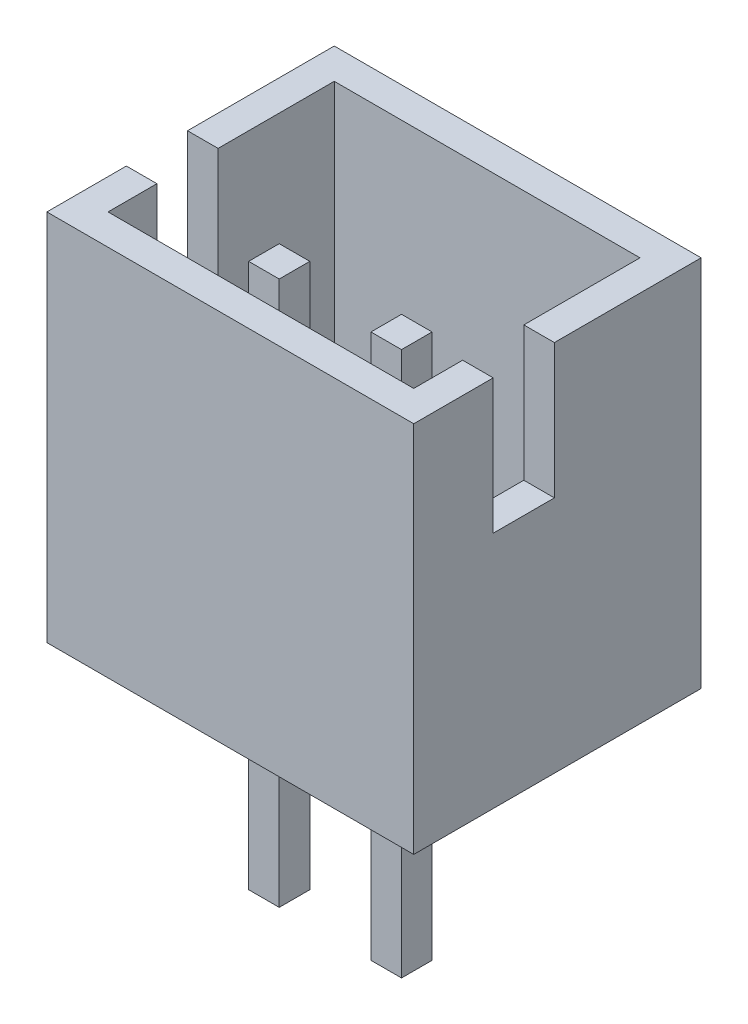
ISO-10303-21;
HEADER;
FILE_DESCRIPTION(('STEP AP214'),'2;1');
FILE_NAME('part.step','',(''),(''),'','','');
FILE_SCHEMA(('AUTOMOTIVE_DESIGN { 1 0 10303 214 1 1 1 1 }'));
ENDSEC;
DATA;
#1=APPLICATION_CONTEXT('core data for automotive mechanical design processes');
#2=APPLICATION_PROTOCOL_DEFINITION('international standard','automotive_design',2000,#1);
#3=PRODUCT_CONTEXT('',#1,'mechanical');
#4=PRODUCT('Part','Part','',(#3));
#5=PRODUCT_RELATED_PRODUCT_CATEGORY('part','',(#4));
#6=PRODUCT_DEFINITION_FORMATION('','',#4);
#7=PRODUCT_DEFINITION_CONTEXT('part definition',#1,'design');
#8=PRODUCT_DEFINITION('design','',#6,#7);
#9=PRODUCT_DEFINITION_SHAPE('','',#8);
#10=(LENGTH_UNIT() NAMED_UNIT(*) SI_UNIT(.MILLI.,.METRE.));
#11=(NAMED_UNIT(*) PLANE_ANGLE_UNIT() SI_UNIT($,.RADIAN.));
#12=(NAMED_UNIT(*) SI_UNIT($,.STERADIAN.) SOLID_ANGLE_UNIT());
#13=UNCERTAINTY_MEASURE_WITH_UNIT(LENGTH_MEASURE(1.E-05),#10,'distance_accuracy_value','');
#14=(GEOMETRIC_REPRESENTATION_CONTEXT(3) GLOBAL_UNCERTAINTY_ASSIGNED_CONTEXT((#13)) GLOBAL_UNIT_ASSIGNED_CONTEXT((#10,
#11,#12)) REPRESENTATION_CONTEXT('',''));
#15=CARTESIAN_POINT('',(0.,0.,0.));
#16=DIRECTION('',(0.,0.,1.));
#17=DIRECTION('',(1.,0.,0.));
#18=AXIS2_PLACEMENT_3D('',#15,#16,#17);
#19=CARTESIAN_POINT('',(0.75,-3.4,0.8));
#20=DIRECTION('',(-1.,0.,0.));
#21=DIRECTION('',(0.,0.,1.));
#22=AXIS2_PLACEMENT_3D('',#19,#20,#21);
#23=PLANE('',#22);
#24=DIRECTION('',(0.,1.,0.));
#25=VECTOR('',#24,1.);
#26=CARTESIAN_POINT('',(0.75,-3.4,0.8));
#27=LINE('',#26,#25);
#28=CARTESIAN_POINT('',(0.75,-3.4,0.8));
#29=VERTEX_POINT('',#28);
#30=CARTESIAN_POINT('',(0.75,5.5,0.8));
#31=VERTEX_POINT('',#30);
#32=EDGE_CURVE('E53',#29,#31,#27,.T.);
#33=ORIENTED_EDGE('',*,*,#32,.T.);
#34=DIRECTION('',(0.,0.,1.));
#35=VECTOR('',#34,1.);
#36=CARTESIAN_POINT('',(0.75,5.5,0.8));
#37=LINE('',#36,#35);
#38=CARTESIAN_POINT('',(0.75,5.5,0.3));
#39=VERTEX_POINT('',#38);
#40=EDGE_CURVE('E90',#39,#31,#37,.T.);
#41=ORIENTED_EDGE('',*,*,#40,.F.);
#42=DIRECTION('',(0.,1.,0.));
#43=VECTOR('',#42,1.);
#44=CARTESIAN_POINT('',(0.75,-3.4,0.3));
#45=LINE('',#44,#43);
#46=CARTESIAN_POINT('',(0.75,-3.4,0.3));
#47=VERTEX_POINT('',#46);
#48=EDGE_CURVE('E12',#47,#39,#45,.T.);
#49=ORIENTED_EDGE('',*,*,#48,.F.);
#50=DIRECTION('',(0.,0.,1.));
#51=VECTOR('',#50,1.);
#52=CARTESIAN_POINT('',(0.75,-3.4,0.8));
#53=LINE('',#52,#51);
#54=EDGE_CURVE('E91',#47,#29,#53,.T.);
#55=ORIENTED_EDGE('',*,*,#54,.T.);
#56=EDGE_LOOP('',(#33,#41,#49,#55));
#57=FACE_BOUND('',#56,.T.);
#58=ADVANCED_FACE('F50',(#57),#23,.T.);
#59=CARTESIAN_POINT('',(0.75,-3.4,0.3));
#60=DIRECTION('',(0.,0.,-1.));
#61=DIRECTION('',(-1.,0.,0.));
#62=AXIS2_PLACEMENT_3D('',#59,#60,#61);
#63=PLANE('',#62);
#64=ORIENTED_EDGE('',*,*,#48,.T.);
#65=DIRECTION('',(-1.,0.,0.));
#66=VECTOR('',#65,1.);
#67=CARTESIAN_POINT('',(0.75,5.5,0.3));
#68=LINE('',#67,#66);
#69=CARTESIAN_POINT('',(1.25,5.5,0.3));
#70=VERTEX_POINT('',#69);
#71=EDGE_CURVE('E107',#70,#39,#68,.T.);
#72=ORIENTED_EDGE('',*,*,#71,.F.);
#73=DIRECTION('',(0.,1.,0.));
#74=VECTOR('',#73,1.);
#75=CARTESIAN_POINT('',(1.25,-3.4,0.3));
#76=LINE('',#75,#74);
#77=CARTESIAN_POINT('',(1.25,-3.4,0.3));
#78=VERTEX_POINT('',#77);
#79=EDGE_CURVE('E58',#78,#70,#76,.T.);
#80=ORIENTED_EDGE('',*,*,#79,.F.);
#81=DIRECTION('',(-1.,0.,0.));
#82=VECTOR('',#81,1.);
#83=CARTESIAN_POINT('',(0.75,-3.4,0.3));
#84=LINE('',#83,#82);
#85=EDGE_CURVE('E96',#78,#47,#84,.T.);
#86=ORIENTED_EDGE('',*,*,#85,.T.);
#87=EDGE_LOOP('',(#64,#72,#80,#86));
#88=FACE_BOUND('',#87,.T.);
#89=ADVANCED_FACE('F122',(#88),#63,.T.);
#90=CARTESIAN_POINT('',(1.25,-3.4,0.800000000000001));
#91=DIRECTION('',(1.,0.,0.));
#92=DIRECTION('',(0.,0.,-1.));
#93=AXIS2_PLACEMENT_3D('',#90,#91,#92);
#94=PLANE('',#93);
#95=ORIENTED_EDGE('',*,*,#79,.T.);
#96=DIRECTION('',(0.,0.,-1.));
#97=VECTOR('',#96,1.);
#98=CARTESIAN_POINT('',(1.25,5.5,0.800000000000001));
#99=LINE('',#98,#97);
#100=CARTESIAN_POINT('',(1.25,5.5,0.800000000000001));
#101=VERTEX_POINT('',#100);
#102=EDGE_CURVE('E103',#101,#70,#99,.T.);
#103=ORIENTED_EDGE('',*,*,#102,.F.);
#104=DIRECTION('',(0.,1.,0.));
#105=VECTOR('',#104,1.);
#106=CARTESIAN_POINT('',(1.25,-3.4,0.800000000000001));
#107=LINE('',#106,#105);
#108=CARTESIAN_POINT('',(1.25,-3.4,0.800000000000001));
#109=VERTEX_POINT('',#108);
#110=EDGE_CURVE('E95',#109,#101,#107,.T.);
#111=ORIENTED_EDGE('',*,*,#110,.F.);
#112=DIRECTION('',(0.,0.,-1.));
#113=VECTOR('',#112,1.);
#114=CARTESIAN_POINT('',(1.25,-3.4,0.800000000000001));
#115=LINE('',#114,#113);
#116=EDGE_CURVE('E115',#109,#78,#115,.T.);
#117=ORIENTED_EDGE('',*,*,#116,.T.);
#118=EDGE_LOOP('',(#95,#103,#111,#117));
#119=FACE_BOUND('',#118,.T.);
#120=ADVANCED_FACE('F119',(#119),#94,.T.);
#121=CARTESIAN_POINT('',(0.75,-3.4,0.8));
#122=DIRECTION('',(0.,0.,1.));
#123=DIRECTION('',(1.,0.,0.));
#124=AXIS2_PLACEMENT_3D('',#121,#122,#123);
#125=PLANE('',#124);
#126=ORIENTED_EDGE('',*,*,#110,.T.);
#127=DIRECTION('',(1.,0.,0.));
#128=VECTOR('',#127,1.);
#129=CARTESIAN_POINT('',(0.75,5.5,0.8));
#130=LINE('',#129,#128);
#131=EDGE_CURVE('E98',#31,#101,#130,.T.);
#132=ORIENTED_EDGE('',*,*,#131,.F.);
#133=ORIENTED_EDGE('',*,*,#32,.F.);
#134=DIRECTION('',(1.,0.,0.));
#135=VECTOR('',#134,1.);
#136=CARTESIAN_POINT('',(0.75,-3.4,0.8));
#137=LINE('',#136,#135);
#138=EDGE_CURVE('E113',#29,#109,#137,.T.);
#139=ORIENTED_EDGE('',*,*,#138,.T.);
#140=EDGE_LOOP('',(#126,#132,#133,#139));
#141=FACE_BOUND('',#140,.T.);
#142=ADVANCED_FACE('F99',(#141),#125,.T.);
#143=CARTESIAN_POINT('',(0.,-3.4,0.));
#144=DIRECTION('',(0.,-1.,0.));
#145=DIRECTION('',(0.,0.,-1.));
#146=AXIS2_PLACEMENT_3D('',#143,#144,#145);
#147=PLANE('',#146);
#148=ORIENTED_EDGE('',*,*,#54,.F.);
#149=ORIENTED_EDGE('',*,*,#85,.F.);
#150=ORIENTED_EDGE('',*,*,#116,.F.);
#151=ORIENTED_EDGE('',*,*,#138,.F.);
#152=EDGE_LOOP('',(#148,#149,#150,#151));
#153=FACE_BOUND('',#152,.T.);
#154=ADVANCED_FACE('F124',(#153),#147,.T.);
#155=CARTESIAN_POINT('',(0.,5.5,0.));
#156=DIRECTION('',(0.,-1.,0.));
#157=DIRECTION('',(0.,0.,-1.));
#158=AXIS2_PLACEMENT_3D('',#155,#156,#157);
#159=PLANE('',#158);
#160=ORIENTED_EDGE('',*,*,#40,.T.);
#161=ORIENTED_EDGE('',*,*,#131,.T.);
#162=ORIENTED_EDGE('',*,*,#102,.T.);
#163=ORIENTED_EDGE('',*,*,#71,.T.);
#164=EDGE_LOOP('',(#160,#161,#162,#163));
#165=FACE_BOUND('',#164,.T.);
#166=ADVANCED_FACE('F106',(#165),#159,.F.);
#167=CLOSED_SHELL('',(#58,#89,#120,#142,#154,#166));
#168=MANIFOLD_SOLID_BREP('B2',#167);
#169=CARTESIAN_POINT('',(-1.25,-3.4,0.800000000000001));
#170=DIRECTION('',(-1.,0.,0.));
#171=DIRECTION('',(0.,0.,1.));
#172=AXIS2_PLACEMENT_3D('',#169,#170,#171);
#173=PLANE('',#172);
#174=DIRECTION('',(0.,1.,0.));
#175=VECTOR('',#174,1.);
#176=CARTESIAN_POINT('',(-1.25,-3.4,0.800000000000001));
#177=LINE('',#176,#175);
#178=CARTESIAN_POINT('',(-1.25,-3.4,0.800000000000001));
#179=VERTEX_POINT('',#178);
#180=CARTESIAN_POINT('',(-1.25,5.5,0.800000000000001));
#181=VERTEX_POINT('',#180);
#182=EDGE_CURVE('E186',#179,#181,#177,.T.);
#183=ORIENTED_EDGE('',*,*,#182,.T.);
#184=DIRECTION('',(0.,0.,1.));
#185=VECTOR('',#184,1.);
#186=CARTESIAN_POINT('',(-1.25,5.5,0.800000000000001));
#187=LINE('',#186,#185);
#188=CARTESIAN_POINT('',(-1.25,5.5,0.3));
#189=VERTEX_POINT('',#188);
#190=EDGE_CURVE('E223',#189,#181,#187,.T.);
#191=ORIENTED_EDGE('',*,*,#190,.F.);
#192=DIRECTION('',(0.,1.,0.));
#193=VECTOR('',#192,1.);
#194=CARTESIAN_POINT('',(-1.25,-3.4,0.3));
#195=LINE('',#194,#193);
#196=CARTESIAN_POINT('',(-1.25,-3.4,0.3));
#197=VERTEX_POINT('',#196);
#198=EDGE_CURVE('E48',#197,#189,#195,.T.);
#199=ORIENTED_EDGE('',*,*,#198,.F.);
#200=DIRECTION('',(0.,0.,1.));
#201=VECTOR('',#200,1.);
#202=CARTESIAN_POINT('',(-1.25,-3.4,0.800000000000001));
#203=LINE('',#202,#201);
#204=EDGE_CURVE('E224',#197,#179,#203,.T.);
#205=ORIENTED_EDGE('',*,*,#204,.T.);
#206=EDGE_LOOP('',(#183,#191,#199,#205));
#207=FACE_BOUND('',#206,.T.);
#208=ADVANCED_FACE('F183',(#207),#173,.T.);
#209=CARTESIAN_POINT('',(-0.75,-3.4,0.3));
#210=DIRECTION('',(0.,0.,-1.));
#211=DIRECTION('',(-1.,0.,0.));
#212=AXIS2_PLACEMENT_3D('',#209,#210,#211);
#213=PLANE('',#212);
#214=ORIENTED_EDGE('',*,*,#198,.T.);
#215=DIRECTION('',(-1.,0.,0.));
#216=VECTOR('',#215,1.);
#217=CARTESIAN_POINT('',(-0.75,5.5,0.3));
#218=LINE('',#217,#216);
#219=CARTESIAN_POINT('',(-0.75,5.5,0.3));
#220=VERTEX_POINT('',#219);
#221=EDGE_CURVE('E240',#220,#189,#218,.T.);
#222=ORIENTED_EDGE('',*,*,#221,.F.);
#223=DIRECTION('',(0.,1.,0.));
#224=VECTOR('',#223,1.);
#225=CARTESIAN_POINT('',(-0.75,-3.4,0.3));
#226=LINE('',#225,#224);
#227=CARTESIAN_POINT('',(-0.75,-3.4,0.3));
#228=VERTEX_POINT('',#227);
#229=EDGE_CURVE('E191',#228,#220,#226,.T.);
#230=ORIENTED_EDGE('',*,*,#229,.F.);
#231=DIRECTION('',(-1.,0.,0.));
#232=VECTOR('',#231,1.);
#233=CARTESIAN_POINT('',(-0.75,-3.4,0.3));
#234=LINE('',#233,#232);
#235=EDGE_CURVE('E229',#228,#197,#234,.T.);
#236=ORIENTED_EDGE('',*,*,#235,.T.);
#237=EDGE_LOOP('',(#214,#222,#230,#236));
#238=FACE_BOUND('',#237,.T.);
#239=ADVANCED_FACE('F255',(#238),#213,.T.);
#240=CARTESIAN_POINT('',(-0.75,-3.4,0.8));
#241=DIRECTION('',(1.,0.,0.));
#242=DIRECTION('',(0.,0.,-1.));
#243=AXIS2_PLACEMENT_3D('',#240,#241,#242);
#244=PLANE('',#243);
#245=ORIENTED_EDGE('',*,*,#229,.T.);
#246=DIRECTION('',(0.,0.,-1.));
#247=VECTOR('',#246,1.);
#248=CARTESIAN_POINT('',(-0.75,5.5,0.8));
#249=LINE('',#248,#247);
#250=CARTESIAN_POINT('',(-0.75,5.5,0.8));
#251=VERTEX_POINT('',#250);
#252=EDGE_CURVE('E236',#251,#220,#249,.T.);
#253=ORIENTED_EDGE('',*,*,#252,.F.);
#254=DIRECTION('',(0.,1.,0.));
#255=VECTOR('',#254,1.);
#256=CARTESIAN_POINT('',(-0.75,-3.4,0.8));
#257=LINE('',#256,#255);
#258=CARTESIAN_POINT('',(-0.75,-3.4,0.8));
#259=VERTEX_POINT('',#258);
#260=EDGE_CURVE('E228',#259,#251,#257,.T.);
#261=ORIENTED_EDGE('',*,*,#260,.F.);
#262=DIRECTION('',(0.,0.,-1.));
#263=VECTOR('',#262,1.);
#264=CARTESIAN_POINT('',(-0.75,-3.4,0.8));
#265=LINE('',#264,#263);
#266=EDGE_CURVE('E248',#259,#228,#265,.T.);
#267=ORIENTED_EDGE('',*,*,#266,.T.);
#268=EDGE_LOOP('',(#245,#253,#261,#267));
#269=FACE_BOUND('',#268,.T.);
#270=ADVANCED_FACE('F252',(#269),#244,.T.);
#271=CARTESIAN_POINT('',(-0.75,-3.4,0.8));
#272=DIRECTION('',(0.,0.,1.));
#273=DIRECTION('',(1.,0.,0.));
#274=AXIS2_PLACEMENT_3D('',#271,#272,#273);
#275=PLANE('',#274);
#276=ORIENTED_EDGE('',*,*,#260,.T.);
#277=DIRECTION('',(1.,0.,0.));
#278=VECTOR('',#277,1.);
#279=CARTESIAN_POINT('',(-0.75,5.5,0.8));
#280=LINE('',#279,#278);
#281=EDGE_CURVE('E231',#181,#251,#280,.T.);
#282=ORIENTED_EDGE('',*,*,#281,.F.);
#283=ORIENTED_EDGE('',*,*,#182,.F.);
#284=DIRECTION('',(1.,0.,0.));
#285=VECTOR('',#284,1.);
#286=CARTESIAN_POINT('',(-0.75,-3.4,0.8));
#287=LINE('',#286,#285);
#288=EDGE_CURVE('E246',#179,#259,#287,.T.);
#289=ORIENTED_EDGE('',*,*,#288,.T.);
#290=EDGE_LOOP('',(#276,#282,#283,#289));
#291=FACE_BOUND('',#290,.T.);
#292=ADVANCED_FACE('F232',(#291),#275,.T.);
#293=CARTESIAN_POINT('',(0.,-3.4,0.));
#294=DIRECTION('',(0.,1.,0.));
#295=DIRECTION('',(0.,0.,1.));
#296=AXIS2_PLACEMENT_3D('',#293,#294,#295);
#297=PLANE('',#296);
#298=ORIENTED_EDGE('',*,*,#204,.F.);
#299=ORIENTED_EDGE('',*,*,#235,.F.);
#300=ORIENTED_EDGE('',*,*,#266,.F.);
#301=ORIENTED_EDGE('',*,*,#288,.F.);
#302=EDGE_LOOP('',(#298,#299,#300,#301));
#303=FACE_BOUND('',#302,.T.);
#304=ADVANCED_FACE('F257',(#303),#297,.F.);
#305=CARTESIAN_POINT('',(0.,5.5,0.));
#306=DIRECTION('',(0.,1.,0.));
#307=DIRECTION('',(0.,0.,1.));
#308=AXIS2_PLACEMENT_3D('',#305,#306,#307);
#309=PLANE('',#308);
#310=ORIENTED_EDGE('',*,*,#190,.T.);
#311=ORIENTED_EDGE('',*,*,#281,.T.);
#312=ORIENTED_EDGE('',*,*,#252,.T.);
#313=ORIENTED_EDGE('',*,*,#221,.T.);
#314=EDGE_LOOP('',(#310,#311,#312,#313));
#315=FACE_BOUND('',#314,.T.);
#316=ADVANCED_FACE('F239',(#315),#309,.T.);
#317=CLOSED_SHELL('',(#208,#239,#270,#292,#304,#316));
#318=MANIFOLD_SOLID_BREP('B6',#317);
#319=CARTESIAN_POINT('',(3.,6.1,2.35));
#320=DIRECTION('',(-1.,0.,0.));
#321=DIRECTION('',(0.,0.,1.));
#322=AXIS2_PLACEMENT_3D('',#319,#320,#321);
#323=PLANE('',#322);
#324=DIRECTION('',(0.,1.,0.));
#325=VECTOR('',#324,1.);
#326=CARTESIAN_POINT('',(3.,3.9,1.05));
#327=LINE('',#326,#325);
#328=CARTESIAN_POINT('',(3.,3.9,1.05));
#329=VERTEX_POINT('',#328);
#330=CARTESIAN_POINT('',(3.,6.1,1.05));
#331=VERTEX_POINT('',#330);
#332=EDGE_CURVE('E428',#329,#331,#327,.T.);
#333=ORIENTED_EDGE('',*,*,#332,.T.);
#334=DIRECTION('',(0.,0.,-1.));
#335=VECTOR('',#334,1.);
#336=CARTESIAN_POINT('',(3.,6.1,2.35));
#337=LINE('',#336,#335);
#338=CARTESIAN_POINT('',(3.,6.1,2.35));
#339=VERTEX_POINT('',#338);
#340=EDGE_CURVE('E446',#339,#331,#337,.T.);
#341=ORIENTED_EDGE('',*,*,#340,.F.);
#342=DIRECTION('',(0.,-1.,0.));
#343=VECTOR('',#342,1.);
#344=CARTESIAN_POINT('',(3.,6.1,2.35));
#345=LINE('',#344,#343);
#346=CARTESIAN_POINT('',(3.,0.,2.35));
#347=VERTEX_POINT('',#346);
#348=EDGE_CURVE('E480',#339,#347,#345,.T.);
#349=ORIENTED_EDGE('',*,*,#348,.T.);
#350=DIRECTION('',(0.,0.,-1.));
#351=VECTOR('',#350,1.);
#352=CARTESIAN_POINT('',(3.,0.,2.35));
#353=LINE('',#352,#351);
#354=CARTESIAN_POINT('',(3.,0.,-2.35));
#355=VERTEX_POINT('',#354);
#356=EDGE_CURVE('E468',#347,#355,#353,.T.);
#357=ORIENTED_EDGE('',*,*,#356,.T.);
#358=DIRECTION('',(0.,-1.,0.));
#359=VECTOR('',#358,1.);
#360=CARTESIAN_POINT('',(3.,6.1,-2.35));
#361=LINE('',#360,#359);
#362=CARTESIAN_POINT('',(3.,6.1,-2.35));
#363=VERTEX_POINT('',#362);
#364=EDGE_CURVE('E443',#363,#355,#361,.T.);
#365=ORIENTED_EDGE('',*,*,#364,.F.);
#366=CARTESIAN_POINT('',(3.,6.1,0.0500000000000005));
#367=VERTEX_POINT('',#366);
#368=EDGE_CURVE('E433',#367,#363,#337,.T.);
#369=ORIENTED_EDGE('',*,*,#368,.F.);
#370=DIRECTION('',(0.,-1.,0.));
#371=VECTOR('',#370,1.);
#372=CARTESIAN_POINT('',(3.,3.9,0.0500000000000005));
#373=LINE('',#372,#371);
#374=CARTESIAN_POINT('',(3.,3.9,0.0500000000000005));
#375=VERTEX_POINT('',#374);
#376=EDGE_CURVE('E419',#367,#375,#373,.T.);
#377=ORIENTED_EDGE('',*,*,#376,.T.);
#378=DIRECTION('',(0.,0.,1.));
#379=VECTOR('',#378,1.);
#380=CARTESIAN_POINT('',(3.,3.9,1.05));
#381=LINE('',#380,#379);
#382=EDGE_CURVE('E439',#375,#329,#381,.T.);
#383=ORIENTED_EDGE('',*,*,#382,.T.);
#384=EDGE_LOOP('',(#333,#341,#349,#357,#365,#369,#377,#383));
#385=FACE_BOUND('',#384,.T.);
#386=ADVANCED_FACE('F307',(#385),#323,.F.);
#387=CARTESIAN_POINT('',(0.,6.1,0.));
#388=DIRECTION('',(0.,1.,0.));
#389=DIRECTION('',(0.,0.,1.));
#390=AXIS2_PLACEMENT_3D('',#387,#388,#389);
#391=PLANE('',#390);
#392=ORIENTED_EDGE('',*,*,#340,.T.);
#393=DIRECTION('',(1.,0.,0.));
#394=VECTOR('',#393,1.);
#395=CARTESIAN_POINT('',(-4.91660919471891,6.1,1.05));
#396=LINE('',#395,#394);
#397=CARTESIAN_POINT('',(2.5,6.1,1.05));
#398=VERTEX_POINT('',#397);
#399=EDGE_CURVE('E438',#398,#331,#396,.T.);
#400=ORIENTED_EDGE('',*,*,#399,.F.);
#401=DIRECTION('',(0.,0.,-1.));
#402=VECTOR('',#401,1.);
#403=CARTESIAN_POINT('',(2.5,6.1,2.35));
#404=LINE('',#403,#402);
#405=CARTESIAN_POINT('',(2.5,6.1,1.85));
#406=VERTEX_POINT('',#405);
#407=EDGE_CURVE('E582',#406,#398,#404,.T.);
#408=ORIENTED_EDGE('',*,*,#407,.F.);
#409=DIRECTION('',(1.,0.,0.));
#410=VECTOR('',#409,1.);
#411=CARTESIAN_POINT('',(3.,6.1,1.85));
#412=LINE('',#411,#410);
#413=CARTESIAN_POINT('',(-2.5,6.1,1.85));
#414=VERTEX_POINT('',#413);
#415=EDGE_CURVE('E579',#414,#406,#412,.T.);
#416=ORIENTED_EDGE('',*,*,#415,.F.);
#417=DIRECTION('',(0.,0.,1.));
#418=VECTOR('',#417,1.);
#419=CARTESIAN_POINT('',(-2.5,6.1,2.35));
#420=LINE('',#419,#418);
#421=CARTESIAN_POINT('',(-2.5,6.1,1.05));
#422=VERTEX_POINT('',#421);
#423=EDGE_CURVE('E574',#422,#414,#420,.T.);
#424=ORIENTED_EDGE('',*,*,#423,.F.);
#425=DIRECTION('',(-1.,0.,0.));
#426=VECTOR('',#425,1.);
#427=CARTESIAN_POINT('',(-0.0833908052810871,6.1,1.05));
#428=LINE('',#427,#426);
#429=CARTESIAN_POINT('',(-3.,6.1,1.05));
#430=VERTEX_POINT('',#429);
#431=EDGE_CURVE('E535',#422,#430,#428,.T.);
#432=ORIENTED_EDGE('',*,*,#431,.T.);
#433=DIRECTION('',(0.,0.,1.));
#434=VECTOR('',#433,1.);
#435=CARTESIAN_POINT('',(-3.,6.1,2.35));
#436=LINE('',#435,#434);
#437=CARTESIAN_POINT('',(-3.,6.1,2.35));
#438=VERTEX_POINT('',#437);
#439=EDGE_CURVE('E474',#430,#438,#436,.T.);
#440=ORIENTED_EDGE('',*,*,#439,.T.);
#441=DIRECTION('',(1.,0.,0.));
#442=VECTOR('',#441,1.);
#443=CARTESIAN_POINT('',(3.,6.1,2.35));
#444=LINE('',#443,#442);
#445=EDGE_CURVE('E447',#438,#339,#444,.T.);
#446=ORIENTED_EDGE('',*,*,#445,.T.);
#447=EDGE_LOOP('',(#392,#400,#408,#416,#424,#432,#440,#446));
#448=FACE_BOUND('',#447,.T.);
#449=ADVANCED_FACE('F594',(#448),#391,.T.);
#450=CARTESIAN_POINT('',(2.5,6.1,0.0500000000000006));
#451=VERTEX_POINT('',#450);
#452=CARTESIAN_POINT('',(2.5,6.1,-1.85));
#453=VERTEX_POINT('',#452);
#454=EDGE_CURVE('E436',#451,#453,#404,.T.);
#455=ORIENTED_EDGE('',*,*,#454,.F.);
#456=DIRECTION('',(1.,0.,0.));
#457=VECTOR('',#456,1.);
#458=CARTESIAN_POINT('',(-4.91660919471891,6.1,0.0500000000000005));
#459=LINE('',#458,#457);
#460=EDGE_CURVE('E323',#451,#367,#459,.T.);
#461=ORIENTED_EDGE('',*,*,#460,.T.);
#462=ORIENTED_EDGE('',*,*,#368,.T.);
#463=DIRECTION('',(-1.,0.,0.));
#464=VECTOR('',#463,1.);
#465=CARTESIAN_POINT('',(3.,6.1,-2.35));
#466=LINE('',#465,#464);
#467=CARTESIAN_POINT('',(-3.,6.1,-2.35));
#468=VERTEX_POINT('',#467);
#469=EDGE_CURVE('E452',#363,#468,#466,.T.);
#470=ORIENTED_EDGE('',*,*,#469,.T.);
#471=CARTESIAN_POINT('',(-3.,6.1,0.0500000000000005));
#472=VERTEX_POINT('',#471);
#473=EDGE_CURVE('E453',#468,#472,#436,.T.);
#474=ORIENTED_EDGE('',*,*,#473,.T.);
#475=DIRECTION('',(-1.,0.,0.));
#476=VECTOR('',#475,1.);
#477=CARTESIAN_POINT('',(-0.0833908052810871,6.1,0.0500000000000005));
#478=LINE('',#477,#476);
#479=CARTESIAN_POINT('',(-2.5,6.1,0.0500000000000003));
#480=VERTEX_POINT('',#479);
#481=EDGE_CURVE('E530',#480,#472,#478,.T.);
#482=ORIENTED_EDGE('',*,*,#481,.F.);
#483=CARTESIAN_POINT('',(-2.5,6.1,-1.85));
#484=VERTEX_POINT('',#483);
#485=EDGE_CURVE('E575',#484,#480,#420,.T.);
#486=ORIENTED_EDGE('',*,*,#485,.F.);
#487=DIRECTION('',(-1.,0.,0.));
#488=VECTOR('',#487,1.);
#489=CARTESIAN_POINT('',(3.,6.1,-1.85));
#490=LINE('',#489,#488);
#491=EDGE_CURVE('E559',#453,#484,#490,.T.);
#492=ORIENTED_EDGE('',*,*,#491,.F.);
#493=EDGE_LOOP('',(#455,#461,#462,#470,#474,#482,#486,#492));
#494=FACE_BOUND('',#493,.T.);
#495=ADVANCED_FACE('F432',(#494),#391,.T.);
#496=CARTESIAN_POINT('',(2.5,6.1,2.35));
#497=DIRECTION('',(-1.,0.,0.));
#498=DIRECTION('',(0.,0.,1.));
#499=AXIS2_PLACEMENT_3D('',#496,#497,#498);
#500=PLANE('',#499);
#501=ORIENTED_EDGE('',*,*,#407,.T.);
#502=DIRECTION('',(0.,-1.,0.));
#503=VECTOR('',#502,1.);
#504=CARTESIAN_POINT('',(2.5,6.1,1.05));
#505=LINE('',#504,#503);
#506=CARTESIAN_POINT('',(2.5,3.9,1.05));
#507=VERTEX_POINT('',#506);
#508=EDGE_CURVE('E181',#398,#507,#505,.T.);
#509=ORIENTED_EDGE('',*,*,#508,.T.);
#510=DIRECTION('',(0.,0.,-1.));
#511=VECTOR('',#510,1.);
#512=CARTESIAN_POINT('',(2.5,3.9,2.35));
#513=LINE('',#512,#511);
#514=CARTESIAN_POINT('',(2.5,3.9,0.0500000000000005));
#515=VERTEX_POINT('',#514);
#516=EDGE_CURVE('E316',#507,#515,#513,.T.);
#517=ORIENTED_EDGE('',*,*,#516,.T.);
#518=DIRECTION('',(0.,1.,0.));
#519=VECTOR('',#518,1.);
#520=CARTESIAN_POINT('',(2.5,6.1,0.0500000000000006));
#521=LINE('',#520,#519);
#522=EDGE_CURVE('E488',#515,#451,#521,.T.);
#523=ORIENTED_EDGE('',*,*,#522,.T.);
#524=ORIENTED_EDGE('',*,*,#454,.T.);
#525=DIRECTION('',(0.,-1.,0.));
#526=VECTOR('',#525,1.);
#527=CARTESIAN_POINT('',(2.5,6.1,-1.85));
#528=LINE('',#527,#526);
#529=CARTESIAN_POINT('',(2.5,0.5,-1.85));
#530=VERTEX_POINT('',#529);
#531=EDGE_CURVE('E558',#453,#530,#528,.T.);
#532=ORIENTED_EDGE('',*,*,#531,.T.);
#533=DIRECTION('',(0.,0.,-1.));
#534=VECTOR('',#533,1.);
#535=CARTESIAN_POINT('',(2.5,0.5,2.35));
#536=LINE('',#535,#534);
#537=CARTESIAN_POINT('',(2.5,0.5,1.85));
#538=VERTEX_POINT('',#537);
#539=EDGE_CURVE('E562',#538,#530,#536,.T.);
#540=ORIENTED_EDGE('',*,*,#539,.F.);
#541=DIRECTION('',(0.,-1.,0.));
#542=VECTOR('',#541,1.);
#543=CARTESIAN_POINT('',(2.5,6.1,1.85));
#544=LINE('',#543,#542);
#545=EDGE_CURVE('E553',#406,#538,#544,.T.);
#546=ORIENTED_EDGE('',*,*,#545,.F.);
#547=EDGE_LOOP('',(#501,#509,#517,#523,#524,#532,#540,#546));
#548=FACE_BOUND('',#547,.T.);
#549=ADVANCED_FACE('F494',(#548),#500,.T.);
#550=CARTESIAN_POINT('',(-3.,6.1,2.35));
#551=DIRECTION('',(1.,0.,0.));
#552=DIRECTION('',(0.,0.,-1.));
#553=AXIS2_PLACEMENT_3D('',#550,#551,#552);
#554=PLANE('',#553);
#555=ORIENTED_EDGE('',*,*,#439,.F.);
#556=DIRECTION('',(0.,1.,0.));
#557=VECTOR('',#556,1.);
#558=CARTESIAN_POINT('',(-3.,3.9,1.05));
#559=LINE('',#558,#557);
#560=CARTESIAN_POINT('',(-3.,3.9,1.05));
#561=VERTEX_POINT('',#560);
#562=EDGE_CURVE('E512',#561,#430,#559,.T.);
#563=ORIENTED_EDGE('',*,*,#562,.F.);
#564=DIRECTION('',(0.,0.,1.));
#565=VECTOR('',#564,1.);
#566=CARTESIAN_POINT('',(-3.,3.9,1.05));
#567=LINE('',#566,#565);
#568=CARTESIAN_POINT('',(-3.,3.9,0.0500000000000005));
#569=VERTEX_POINT('',#568);
#570=EDGE_CURVE('E516',#569,#561,#567,.T.);
#571=ORIENTED_EDGE('',*,*,#570,.F.);
#572=DIRECTION('',(0.,-1.,0.));
#573=VECTOR('',#572,1.);
#574=CARTESIAN_POINT('',(-3.,3.9,0.0500000000000005));
#575=LINE('',#574,#573);
#576=EDGE_CURVE('E507',#472,#569,#575,.T.);
#577=ORIENTED_EDGE('',*,*,#576,.F.);
#578=ORIENTED_EDGE('',*,*,#473,.F.);
#579=DIRECTION('',(0.,-1.,0.));
#580=VECTOR('',#579,1.);
#581=CARTESIAN_POINT('',(-3.,6.1,-2.35));
#582=LINE('',#581,#580);
#583=CARTESIAN_POINT('',(-3.,0.,-2.35));
#584=VERTEX_POINT('',#583);
#585=EDGE_CURVE('E459',#468,#584,#582,.T.);
#586=ORIENTED_EDGE('',*,*,#585,.T.);
#587=DIRECTION('',(0.,0.,1.));
#588=VECTOR('',#587,1.);
#589=CARTESIAN_POINT('',(-3.,0.,2.35));
#590=LINE('',#589,#588);
#591=CARTESIAN_POINT('',(-3.,0.,2.35));
#592=VERTEX_POINT('',#591);
#593=EDGE_CURVE('E460',#584,#592,#590,.T.);
#594=ORIENTED_EDGE('',*,*,#593,.T.);
#595=DIRECTION('',(0.,-1.,0.));
#596=VECTOR('',#595,1.);
#597=CARTESIAN_POINT('',(-3.,6.1,2.35));
#598=LINE('',#597,#596);
#599=EDGE_CURVE('E484',#438,#592,#598,.T.);
#600=ORIENTED_EDGE('',*,*,#599,.F.);
#601=EDGE_LOOP('',(#555,#563,#571,#577,#578,#586,#594,#600));
#602=FACE_BOUND('',#601,.T.);
#603=ADVANCED_FACE('F309',(#602),#554,.F.);
#604=CARTESIAN_POINT('',(3.,6.1,2.35));
#605=DIRECTION('',(0.,0.,-1.));
#606=DIRECTION('',(-1.,0.,0.));
#607=AXIS2_PLACEMENT_3D('',#604,#605,#606);
#608=PLANE('',#607);
#609=DIRECTION('',(1.,0.,0.));
#610=VECTOR('',#609,1.);
#611=CARTESIAN_POINT('',(3.,0.,2.35));
#612=LINE('',#611,#610);
#613=EDGE_CURVE('E464',#592,#347,#612,.T.);
#614=ORIENTED_EDGE('',*,*,#613,.T.);
#615=ORIENTED_EDGE('',*,*,#348,.F.);
#616=ORIENTED_EDGE('',*,*,#445,.F.);
#617=ORIENTED_EDGE('',*,*,#599,.T.);
#618=EDGE_LOOP('',(#614,#615,#616,#617));
#619=FACE_BOUND('',#618,.T.);
#620=ADVANCED_FACE('F601',(#619),#608,.F.);
#621=CARTESIAN_POINT('',(3.,6.1,-2.35));
#622=DIRECTION('',(0.,0.,1.));
#623=DIRECTION('',(1.,0.,0.));
#624=AXIS2_PLACEMENT_3D('',#621,#622,#623);
#625=PLANE('',#624);
#626=DIRECTION('',(-1.,0.,0.));
#627=VECTOR('',#626,1.);
#628=CARTESIAN_POINT('',(3.,0.,-2.35));
#629=LINE('',#628,#627);
#630=EDGE_CURVE('E471',#355,#584,#629,.T.);
#631=ORIENTED_EDGE('',*,*,#630,.T.);
#632=ORIENTED_EDGE('',*,*,#585,.F.);
#633=ORIENTED_EDGE('',*,*,#469,.F.);
#634=ORIENTED_EDGE('',*,*,#364,.T.);
#635=EDGE_LOOP('',(#631,#632,#633,#634));
#636=FACE_BOUND('',#635,.T.);
#637=ADVANCED_FACE('F647',(#636),#625,.F.);
#638=CARTESIAN_POINT('',(0.,0.,0.));
#639=DIRECTION('',(0.,1.,0.));
#640=DIRECTION('',(0.,0.,1.));
#641=AXIS2_PLACEMENT_3D('',#638,#639,#640);
#642=PLANE('',#641);
#643=ORIENTED_EDGE('',*,*,#593,.F.);
#644=ORIENTED_EDGE('',*,*,#630,.F.);
#645=ORIENTED_EDGE('',*,*,#356,.F.);
#646=ORIENTED_EDGE('',*,*,#613,.F.);
#647=EDGE_LOOP('',(#643,#644,#645,#646));
#648=FACE_BOUND('',#647,.T.);
#649=ADVANCED_FACE('F607',(#648),#642,.F.);
#650=CARTESIAN_POINT('',(-2.5,6.1,2.35));
#651=DIRECTION('',(1.,0.,0.));
#652=DIRECTION('',(0.,0.,-1.));
#653=AXIS2_PLACEMENT_3D('',#650,#651,#652);
#654=PLANE('',#653);
#655=DIRECTION('',(0.,1.,0.));
#656=VECTOR('',#655,1.);
#657=CARTESIAN_POINT('',(-2.5,3.9,1.05));
#658=LINE('',#657,#656);
#659=CARTESIAN_POINT('',(-2.5,3.9,1.05));
#660=VERTEX_POINT('',#659);
#661=EDGE_CURVE('E531',#660,#422,#658,.T.);
#662=ORIENTED_EDGE('',*,*,#661,.T.);
#663=ORIENTED_EDGE('',*,*,#423,.T.);
#664=DIRECTION('',(0.,-1.,0.));
#665=VECTOR('',#664,1.);
#666=CARTESIAN_POINT('',(-2.5,6.1,1.85));
#667=LINE('',#666,#665);
#668=CARTESIAN_POINT('',(-2.5,0.5,1.85));
#669=VERTEX_POINT('',#668);
#670=EDGE_CURVE('E465',#414,#669,#667,.T.);
#671=ORIENTED_EDGE('',*,*,#670,.T.);
#672=DIRECTION('',(0.,0.,1.));
#673=VECTOR('',#672,1.);
#674=CARTESIAN_POINT('',(-2.5,0.5,2.35));
#675=LINE('',#674,#673);
#676=CARTESIAN_POINT('',(-2.5,0.5,-1.85));
#677=VERTEX_POINT('',#676);
#678=EDGE_CURVE('E545',#677,#669,#675,.T.);
#679=ORIENTED_EDGE('',*,*,#678,.F.);
#680=DIRECTION('',(0.,-1.,0.));
#681=VECTOR('',#680,1.);
#682=CARTESIAN_POINT('',(-2.5,6.1,-1.85));
#683=LINE('',#682,#681);
#684=EDGE_CURVE('E554',#484,#677,#683,.T.);
#685=ORIENTED_EDGE('',*,*,#684,.F.);
#686=ORIENTED_EDGE('',*,*,#485,.T.);
#687=DIRECTION('',(0.,-1.,0.));
#688=VECTOR('',#687,1.);
#689=CARTESIAN_POINT('',(-2.5,3.9,0.0500000000000005));
#690=LINE('',#689,#688);
#691=CARTESIAN_POINT('',(-2.5,3.9,0.0500000000000006));
#692=VERTEX_POINT('',#691);
#693=EDGE_CURVE('E526',#480,#692,#690,.T.);
#694=ORIENTED_EDGE('',*,*,#693,.T.);
#695=DIRECTION('',(0.,0.,1.));
#696=VECTOR('',#695,1.);
#697=CARTESIAN_POINT('',(-2.5,3.9,1.05));
#698=LINE('',#697,#696);
#699=EDGE_CURVE('E515',#692,#660,#698,.T.);
#700=ORIENTED_EDGE('',*,*,#699,.T.);
#701=EDGE_LOOP('',(#662,#663,#671,#679,#685,#686,#694,#700));
#702=FACE_BOUND('',#701,.T.);
#703=ADVANCED_FACE('F625',(#702),#654,.T.);
#704=CARTESIAN_POINT('',(3.,6.1,1.85));
#705=DIRECTION('',(0.,0.,-1.));
#706=DIRECTION('',(-1.,0.,0.));
#707=AXIS2_PLACEMENT_3D('',#704,#705,#706);
#708=PLANE('',#707);
#709=DIRECTION('',(1.,0.,0.));
#710=VECTOR('',#709,1.);
#711=CARTESIAN_POINT('',(3.,0.5,1.85));
#712=LINE('',#711,#710);
#713=EDGE_CURVE('E549',#669,#538,#712,.T.);
#714=ORIENTED_EDGE('',*,*,#713,.F.);
#715=ORIENTED_EDGE('',*,*,#670,.F.);
#716=ORIENTED_EDGE('',*,*,#415,.T.);
#717=ORIENTED_EDGE('',*,*,#545,.T.);
#718=EDGE_LOOP('',(#714,#715,#716,#717));
#719=FACE_BOUND('',#718,.T.);
#720=ADVANCED_FACE('F614',(#719),#708,.T.);
#721=CARTESIAN_POINT('',(3.,6.1,-1.85));
#722=DIRECTION('',(0.,0.,1.));
#723=DIRECTION('',(1.,0.,0.));
#724=AXIS2_PLACEMENT_3D('',#721,#722,#723);
#725=PLANE('',#724);
#726=DIRECTION('',(-1.,0.,0.));
#727=VECTOR('',#726,1.);
#728=CARTESIAN_POINT('',(3.,0.5,-1.85));
#729=LINE('',#728,#727);
#730=EDGE_CURVE('E568',#530,#677,#729,.T.);
#731=ORIENTED_EDGE('',*,*,#730,.F.);
#732=ORIENTED_EDGE('',*,*,#531,.F.);
#733=ORIENTED_EDGE('',*,*,#491,.T.);
#734=ORIENTED_EDGE('',*,*,#684,.T.);
#735=EDGE_LOOP('',(#731,#732,#733,#734));
#736=FACE_BOUND('',#735,.T.);
#737=ADVANCED_FACE('F622',(#736),#725,.T.);
#738=CARTESIAN_POINT('',(0.,0.5,0.));
#739=DIRECTION('',(0.,1.,0.));
#740=DIRECTION('',(0.,0.,1.));
#741=AXIS2_PLACEMENT_3D('',#738,#739,#740);
#742=PLANE('',#741);
#743=ORIENTED_EDGE('',*,*,#678,.T.);
#744=ORIENTED_EDGE('',*,*,#713,.T.);
#745=ORIENTED_EDGE('',*,*,#539,.T.);
#746=ORIENTED_EDGE('',*,*,#730,.T.);
#747=EDGE_LOOP('',(#743,#744,#745,#746));
#748=FACE_BOUND('',#747,.T.);
#749=ADVANCED_FACE('F628',(#748),#742,.T.);
#750=CARTESIAN_POINT('',(-0.0833908052810871,3.9,1.05));
#751=DIRECTION('',(0.,-1.,0.));
#752=DIRECTION('',(0.,0.,-1.));
#753=AXIS2_PLACEMENT_3D('',#750,#751,#752);
#754=PLANE('',#753);
#755=DIRECTION('',(-1.,0.,0.));
#756=VECTOR('',#755,1.);
#757=CARTESIAN_POINT('',(-0.0833908052810871,3.9,0.0500000000000005));
#758=LINE('',#757,#756);
#759=EDGE_CURVE('E331',#692,#569,#758,.T.);
#760=ORIENTED_EDGE('',*,*,#759,.T.);
#761=ORIENTED_EDGE('',*,*,#570,.T.);
#762=DIRECTION('',(-1.,0.,0.));
#763=VECTOR('',#762,1.);
#764=CARTESIAN_POINT('',(-0.0833908052810871,3.9,1.05));
#765=LINE('',#764,#763);
#766=EDGE_CURVE('E525',#660,#561,#765,.T.);
#767=ORIENTED_EDGE('',*,*,#766,.F.);
#768=ORIENTED_EDGE('',*,*,#699,.F.);
#769=EDGE_LOOP('',(#760,#761,#767,#768));
#770=FACE_BOUND('',#769,.T.);
#771=ADVANCED_FACE('F630',(#770),#754,.F.);
#772=CARTESIAN_POINT('',(-0.0833908052810871,3.9,1.05));
#773=DIRECTION('',(0.,0.,1.));
#774=DIRECTION('',(1.,0.,0.));
#775=AXIS2_PLACEMENT_3D('',#772,#773,#774);
#776=PLANE('',#775);
#777=ORIENTED_EDGE('',*,*,#766,.T.);
#778=ORIENTED_EDGE('',*,*,#562,.T.);
#779=ORIENTED_EDGE('',*,*,#431,.F.);
#780=ORIENTED_EDGE('',*,*,#661,.F.);
#781=EDGE_LOOP('',(#777,#778,#779,#780));
#782=FACE_BOUND('',#781,.T.);
#783=ADVANCED_FACE('F636',(#782),#776,.F.);
#784=CARTESIAN_POINT('',(-0.0833908052810871,3.9,0.0500000000000005));
#785=DIRECTION('',(0.,0.,-1.));
#786=DIRECTION('',(-1.,0.,0.));
#787=AXIS2_PLACEMENT_3D('',#784,#785,#786);
#788=PLANE('',#787);
#789=ORIENTED_EDGE('',*,*,#481,.T.);
#790=ORIENTED_EDGE('',*,*,#576,.T.);
#791=ORIENTED_EDGE('',*,*,#759,.F.);
#792=ORIENTED_EDGE('',*,*,#693,.F.);
#793=EDGE_LOOP('',(#789,#790,#791,#792));
#794=FACE_BOUND('',#793,.T.);
#795=ADVANCED_FACE('F669',(#794),#788,.F.);
#796=CARTESIAN_POINT('',(-4.91660919471891,3.9,1.05));
#797=DIRECTION('',(0.,0.,-1.));
#798=DIRECTION('',(-1.,0.,0.));
#799=AXIS2_PLACEMENT_3D('',#796,#797,#798);
#800=PLANE('',#799);
#801=ORIENTED_EDGE('',*,*,#399,.T.);
#802=ORIENTED_EDGE('',*,*,#332,.F.);
#803=DIRECTION('',(1.,0.,0.));
#804=VECTOR('',#803,1.);
#805=CARTESIAN_POINT('',(-4.91660919471891,3.9,1.05));
#806=LINE('',#805,#804);
#807=EDGE_CURVE('E498',#507,#329,#806,.T.);
#808=ORIENTED_EDGE('',*,*,#807,.F.);
#809=ORIENTED_EDGE('',*,*,#508,.F.);
#810=EDGE_LOOP('',(#801,#802,#808,#809));
#811=FACE_BOUND('',#810,.T.);
#812=ADVANCED_FACE('F501',(#811),#800,.T.);
#813=CARTESIAN_POINT('',(-4.91660919471891,3.9,1.05));
#814=DIRECTION('',(0.,1.,0.));
#815=DIRECTION('',(0.,0.,1.));
#816=AXIS2_PLACEMENT_3D('',#813,#814,#815);
#817=PLANE('',#816);
#818=ORIENTED_EDGE('',*,*,#807,.T.);
#819=ORIENTED_EDGE('',*,*,#382,.F.);
#820=DIRECTION('',(1.,0.,0.));
#821=VECTOR('',#820,1.);
#822=CARTESIAN_POINT('',(-4.91660919471891,3.9,0.0500000000000005));
#823=LINE('',#822,#821);
#824=EDGE_CURVE('E422',#515,#375,#823,.T.);
#825=ORIENTED_EDGE('',*,*,#824,.F.);
#826=ORIENTED_EDGE('',*,*,#516,.F.);
#827=EDGE_LOOP('',(#818,#819,#825,#826));
#828=FACE_BOUND('',#827,.T.);
#829=ADVANCED_FACE('F497',(#828),#817,.T.);
#830=CARTESIAN_POINT('',(-4.91660919471891,3.9,0.0500000000000005));
#831=DIRECTION('',(0.,0.,1.));
#832=DIRECTION('',(1.,0.,0.));
#833=AXIS2_PLACEMENT_3D('',#830,#831,#832);
#834=PLANE('',#833);
#835=ORIENTED_EDGE('',*,*,#824,.T.);
#836=ORIENTED_EDGE('',*,*,#376,.F.);
#837=ORIENTED_EDGE('',*,*,#460,.F.);
#838=ORIENTED_EDGE('',*,*,#522,.F.);
#839=EDGE_LOOP('',(#835,#836,#837,#838));
#840=FACE_BOUND('',#839,.T.);
#841=ADVANCED_FACE('F420',(#840),#834,.T.);
#842=CLOSED_SHELL('',(#386,#449,#495,#549,#603,#620,#637,#649,#703,#720,#737,#749,#771,#783,
#795,#812,#829,#841));
#843=MANIFOLD_SOLID_BREP('B42',#842);
#844=ADVANCED_BREP_SHAPE_REPRESENTATION('',(#18,#168,#318,#843),#14);
#845=SHAPE_DEFINITION_REPRESENTATION(#9,#844);
ENDSEC;
END-ISO-10303-21;
